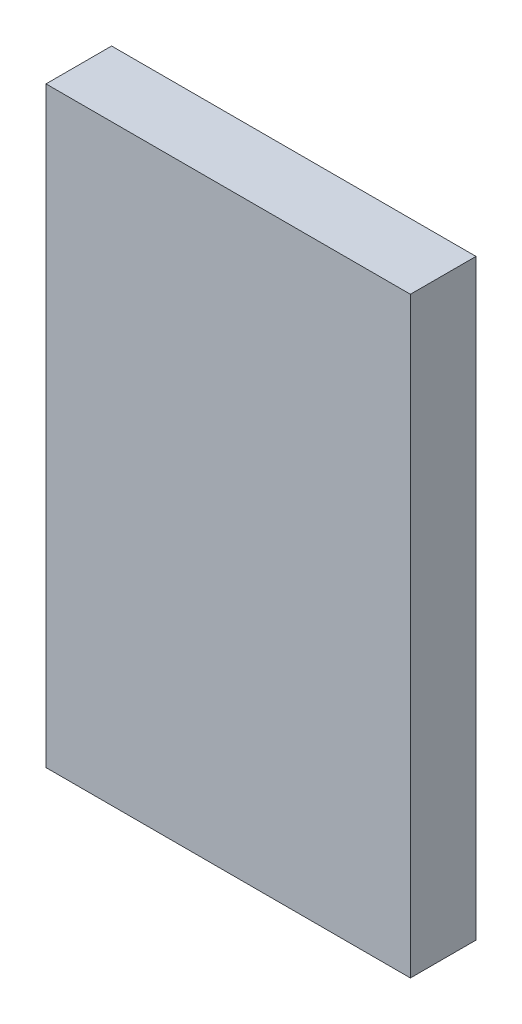
ISO-10303-21;
HEADER;
FILE_DESCRIPTION(('STEP AP214'),'2;1');
FILE_NAME('part.step','',(''),(''),'','','');
FILE_SCHEMA(('AUTOMOTIVE_DESIGN { 1 0 10303 214 1 1 1 1 }'));
ENDSEC;
DATA;
#1=APPLICATION_CONTEXT('core data for automotive mechanical design processes');
#2=APPLICATION_PROTOCOL_DEFINITION('international standard','automotive_design',2000,#1);
#3=PRODUCT_CONTEXT('',#1,'mechanical');
#4=PRODUCT('Part','Part','',(#3));
#5=PRODUCT_RELATED_PRODUCT_CATEGORY('part','',(#4));
#6=PRODUCT_DEFINITION_FORMATION('','',#4);
#7=PRODUCT_DEFINITION_CONTEXT('part definition',#1,'design');
#8=PRODUCT_DEFINITION('design','',#6,#7);
#9=PRODUCT_DEFINITION_SHAPE('','',#8);
#10=(LENGTH_UNIT() NAMED_UNIT(*) SI_UNIT(.MILLI.,.METRE.));
#11=(NAMED_UNIT(*) PLANE_ANGLE_UNIT() SI_UNIT($,.RADIAN.));
#12=(NAMED_UNIT(*) SI_UNIT($,.STERADIAN.) SOLID_ANGLE_UNIT());
#13=UNCERTAINTY_MEASURE_WITH_UNIT(LENGTH_MEASURE(1.E-05),#10,'distance_accuracy_value','');
#14=(GEOMETRIC_REPRESENTATION_CONTEXT(3) GLOBAL_UNCERTAINTY_ASSIGNED_CONTEXT((#13)) GLOBAL_UNIT_ASSIGNED_CONTEXT((#10,
#11,#12)) REPRESENTATION_CONTEXT('',''));
#15=CARTESIAN_POINT('',(0.,0.,0.));
#16=DIRECTION('',(0.,0.,1.));
#17=DIRECTION('',(1.,0.,0.));
#18=AXIS2_PLACEMENT_3D('',#15,#16,#17);
#19=CARTESIAN_POINT('',(0.,0.,7.2));
#20=DIRECTION('',(0.,1.,0.));
#21=DIRECTION('',(0.,0.,1.));
#22=AXIS2_PLACEMENT_3D('',#19,#20,#21);
#23=PLANE('',#22);
#24=DIRECTION('',(1.,0.,0.));
#25=VECTOR('',#24,1.);
#26=CARTESIAN_POINT('',(0.,0.,0.));
#27=LINE('',#26,#25);
#28=CARTESIAN_POINT('',(-40.,0.,0.));
#29=VERTEX_POINT('',#28);
#30=CARTESIAN_POINT('',(0.,0.,0.));
#31=VERTEX_POINT('',#30);
#32=EDGE_CURVE('E107',#29,#31,#27,.T.);
#33=ORIENTED_EDGE('',*,*,#32,.T.);
#34=DIRECTION('',(0.,0.,-1.));
#35=VECTOR('',#34,1.);
#36=CARTESIAN_POINT('',(0.,0.,7.2));
#37=LINE('',#36,#35);
#38=CARTESIAN_POINT('',(0.,0.,7.2));
#39=VERTEX_POINT('',#38);
#40=EDGE_CURVE('E11',#39,#31,#37,.T.);
#41=ORIENTED_EDGE('',*,*,#40,.F.);
#42=DIRECTION('',(1.,0.,0.));
#43=VECTOR('',#42,1.);
#44=CARTESIAN_POINT('',(0.,0.,7.2));
#45=LINE('',#44,#43);
#46=CARTESIAN_POINT('',(-40.,0.,7.2));
#47=VERTEX_POINT('',#46);
#48=EDGE_CURVE('E95',#47,#39,#45,.T.);
#49=ORIENTED_EDGE('',*,*,#48,.F.);
#50=DIRECTION('',(0.,0.,-1.));
#51=VECTOR('',#50,1.);
#52=CARTESIAN_POINT('',(-40.,0.,7.2));
#53=LINE('',#52,#51);
#54=EDGE_CURVE('E103',#47,#29,#53,.T.);
#55=ORIENTED_EDGE('',*,*,#54,.T.);
#56=EDGE_LOOP('',(#33,#41,#49,#55));
#57=FACE_BOUND('',#56,.T.);
#58=ADVANCED_FACE('F44',(#57),#23,.F.);
#59=CARTESIAN_POINT('',(0.,0.,7.2));
#60=DIRECTION('',(-1.,0.,0.));
#61=DIRECTION('',(0.,0.,1.));
#62=AXIS2_PLACEMENT_3D('',#59,#60,#61);
#63=PLANE('',#62);
#64=DIRECTION('',(0.,1.,0.));
#65=VECTOR('',#64,1.);
#66=CARTESIAN_POINT('',(0.,0.,0.));
#67=LINE('',#66,#65);
#68=CARTESIAN_POINT('',(0.,65.,0.));
#69=VERTEX_POINT('',#68);
#70=EDGE_CURVE('E99',#31,#69,#67,.T.);
#71=ORIENTED_EDGE('',*,*,#70,.T.);
#72=DIRECTION('',(0.,0.,-1.));
#73=VECTOR('',#72,1.);
#74=CARTESIAN_POINT('',(0.,65.,7.2));
#75=LINE('',#74,#73);
#76=CARTESIAN_POINT('',(0.,65.,7.2));
#77=VERTEX_POINT('',#76);
#78=EDGE_CURVE('E52',#77,#69,#75,.T.);
#79=ORIENTED_EDGE('',*,*,#78,.F.);
#80=DIRECTION('',(0.,1.,0.));
#81=VECTOR('',#80,1.);
#82=CARTESIAN_POINT('',(0.,0.,7.2));
#83=LINE('',#82,#81);
#84=EDGE_CURVE('E90',#39,#77,#83,.T.);
#85=ORIENTED_EDGE('',*,*,#84,.F.);
#86=ORIENTED_EDGE('',*,*,#40,.T.);
#87=EDGE_LOOP('',(#71,#79,#85,#86));
#88=FACE_BOUND('',#87,.T.);
#89=ADVANCED_FACE('F98',(#88),#63,.F.);
#90=CARTESIAN_POINT('',(0.,65.,7.2));
#91=DIRECTION('',(0.,-1.,0.));
#92=DIRECTION('',(0.,0.,-1.));
#93=AXIS2_PLACEMENT_3D('',#90,#91,#92);
#94=PLANE('',#93);
#95=DIRECTION('',(-1.,0.,0.));
#96=VECTOR('',#95,1.);
#97=CARTESIAN_POINT('',(0.,65.,0.));
#98=LINE('',#97,#96);
#99=CARTESIAN_POINT('',(-40.,65.,0.));
#100=VERTEX_POINT('',#99);
#101=EDGE_CURVE('E77',#69,#100,#98,.T.);
#102=ORIENTED_EDGE('',*,*,#101,.T.);
#103=DIRECTION('',(0.,0.,-1.));
#104=VECTOR('',#103,1.);
#105=CARTESIAN_POINT('',(-40.,65.,7.2));
#106=LINE('',#105,#104);
#107=CARTESIAN_POINT('',(-40.,65.,7.2));
#108=VERTEX_POINT('',#107);
#109=EDGE_CURVE('E100',#108,#100,#106,.T.);
#110=ORIENTED_EDGE('',*,*,#109,.F.);
#111=DIRECTION('',(-1.,0.,0.));
#112=VECTOR('',#111,1.);
#113=CARTESIAN_POINT('',(0.,65.,7.2));
#114=LINE('',#113,#112);
#115=EDGE_CURVE('E93',#77,#108,#114,.T.);
#116=ORIENTED_EDGE('',*,*,#115,.F.);
#117=ORIENTED_EDGE('',*,*,#78,.T.);
#118=EDGE_LOOP('',(#102,#110,#116,#117));
#119=FACE_BOUND('',#118,.T.);
#120=ADVANCED_FACE('F101',(#119),#94,.F.);
#121=CARTESIAN_POINT('',(-40.,0.,7.2));
#122=DIRECTION('',(1.,0.,0.));
#123=DIRECTION('',(0.,0.,-1.));
#124=AXIS2_PLACEMENT_3D('',#121,#122,#123);
#125=PLANE('',#124);
#126=DIRECTION('',(0.,-1.,0.));
#127=VECTOR('',#126,1.);
#128=CARTESIAN_POINT('',(-40.,0.,0.));
#129=LINE('',#128,#127);
#130=EDGE_CURVE('E83',#100,#29,#129,.T.);
#131=ORIENTED_EDGE('',*,*,#130,.T.);
#132=ORIENTED_EDGE('',*,*,#54,.F.);
#133=DIRECTION('',(0.,-1.,0.));
#134=VECTOR('',#133,1.);
#135=CARTESIAN_POINT('',(-40.,0.,7.2));
#136=LINE('',#135,#134);
#137=EDGE_CURVE('E60',#108,#47,#136,.T.);
#138=ORIENTED_EDGE('',*,*,#137,.F.);
#139=ORIENTED_EDGE('',*,*,#109,.T.);
#140=EDGE_LOOP('',(#131,#132,#138,#139));
#141=FACE_BOUND('',#140,.T.);
#142=ADVANCED_FACE('F114',(#141),#125,.F.);
#143=CARTESIAN_POINT('',(0.,0.,7.2));
#144=DIRECTION('',(0.,0.,-1.));
#145=DIRECTION('',(-1.,0.,0.));
#146=AXIS2_PLACEMENT_3D('',#143,#144,#145);
#147=PLANE('',#146);
#148=ORIENTED_EDGE('',*,*,#48,.T.);
#149=ORIENTED_EDGE('',*,*,#84,.T.);
#150=ORIENTED_EDGE('',*,*,#115,.T.);
#151=ORIENTED_EDGE('',*,*,#137,.T.);
#152=EDGE_LOOP('',(#148,#149,#150,#151));
#153=FACE_BOUND('',#152,.T.);
#154=ADVANCED_FACE('F91',(#153),#147,.F.);
#155=CARTESIAN_POINT('',(0.,0.,0.));
#156=DIRECTION('',(0.,0.,-1.));
#157=DIRECTION('',(-1.,0.,0.));
#158=AXIS2_PLACEMENT_3D('',#155,#156,#157);
#159=PLANE('',#158);
#160=ORIENTED_EDGE('',*,*,#32,.F.);
#161=ORIENTED_EDGE('',*,*,#130,.F.);
#162=ORIENTED_EDGE('',*,*,#101,.F.);
#163=ORIENTED_EDGE('',*,*,#70,.F.);
#164=EDGE_LOOP('',(#160,#161,#162,#163));
#165=FACE_BOUND('',#164,.T.);
#166=ADVANCED_FACE('F117',(#165),#159,.T.);
#167=CLOSED_SHELL('',(#58,#89,#120,#142,#154,#166));
#168=MANIFOLD_SOLID_BREP('B2',#167);
#169=ADVANCED_BREP_SHAPE_REPRESENTATION('',(#18,#168),#14);
#170=SHAPE_DEFINITION_REPRESENTATION(#9,#169);
ENDSEC;
END-ISO-10303-21;
